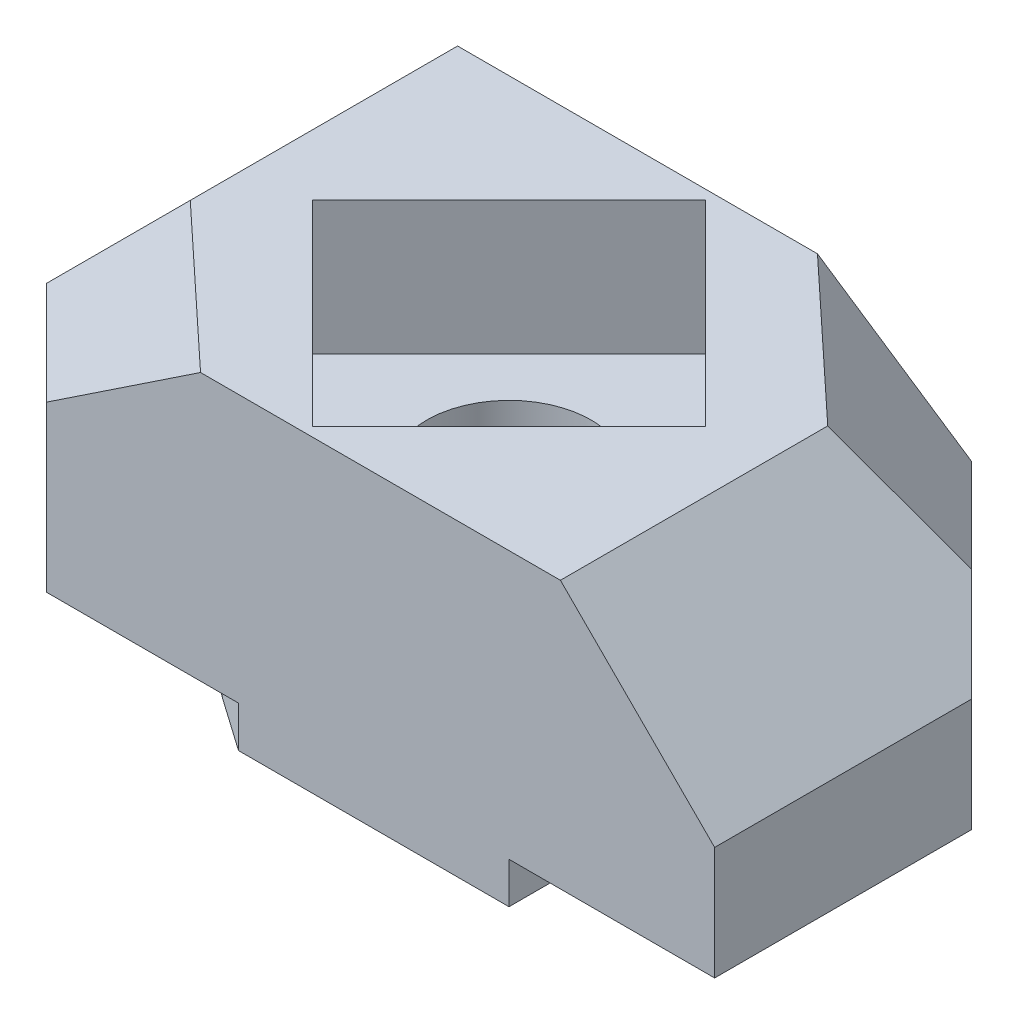
ISO-10303-21;
HEADER;
FILE_DESCRIPTION(('STEP AP214'),'2;1');
FILE_NAME('part.step','',(''),(''),'','','');
FILE_SCHEMA(('AUTOMOTIVE_DESIGN { 1 0 10303 214 1 1 1 1 }'));
ENDSEC;
DATA;
#1=APPLICATION_CONTEXT('core data for automotive mechanical design processes');
#2=APPLICATION_PROTOCOL_DEFINITION('international standard','automotive_design',2000,#1);
#3=PRODUCT_CONTEXT('',#1,'mechanical');
#4=PRODUCT('Part','Part','',(#3));
#5=PRODUCT_RELATED_PRODUCT_CATEGORY('part','',(#4));
#6=PRODUCT_DEFINITION_FORMATION('','',#4);
#7=PRODUCT_DEFINITION_CONTEXT('part definition',#1,'design');
#8=PRODUCT_DEFINITION('design','',#6,#7);
#9=PRODUCT_DEFINITION_SHAPE('','',#8);
#10=(LENGTH_UNIT() NAMED_UNIT(*) SI_UNIT(.MILLI.,.METRE.));
#11=(NAMED_UNIT(*) PLANE_ANGLE_UNIT() SI_UNIT($,.RADIAN.));
#12=(NAMED_UNIT(*) SI_UNIT($,.STERADIAN.) SOLID_ANGLE_UNIT());
#13=UNCERTAINTY_MEASURE_WITH_UNIT(LENGTH_MEASURE(1.E-05),#10,'distance_accuracy_value','');
#14=(GEOMETRIC_REPRESENTATION_CONTEXT(3) GLOBAL_UNCERTAINTY_ASSIGNED_CONTEXT((#13)) GLOBAL_UNIT_ASSIGNED_CONTEXT((#10,
#11,#12)) REPRESENTATION_CONTEXT('',''));
#15=CARTESIAN_POINT('',(0.,0.,0.));
#16=DIRECTION('',(0.,0.,1.));
#17=DIRECTION('',(1.,0.,0.));
#18=AXIS2_PLACEMENT_3D('',#15,#16,#17);
#19=CARTESIAN_POINT('',(3.20278422273782,4.80417633410673,-3.43155452436195));
#20=DIRECTION('',(-0.47684189230312,-0.71526283845468,0.510902027467629));
#21=DIRECTION('',(0.,-0.581238193719096,-0.813733471206735));
#22=AXIS2_PLACEMENT_3D('',#19,#20,#21);
#23=PLANE('',#22);
#24=DIRECTION('',(0.731055268242869,0.,0.682318250360011));
#25=VECTOR('',#24,1.);
#26=CARTESIAN_POINT('',(2.92636579572446,5.2,-3.13539192399049));
#27=LINE('',#26,#25);
#28=CARTESIAN_POINT('',(1.99999999999999,5.2,-4.));
#29=VERTEX_POINT('',#28);
#30=CARTESIAN_POINT('',(4.99999999999999,5.2,-1.2));
#31=VERTEX_POINT('',#30);
#32=EDGE_CURVE('E52',#29,#31,#27,.T.);
#33=ORIENTED_EDGE('',*,*,#32,.T.);
#34=DIRECTION('',(0.671492221553768,-0.671492221553768,-0.313363036725092));
#35=VECTOR('',#34,1.);
#36=CARTESIAN_POINT('',(4.74749498997995,5.45250501002004,-1.08216432865732));
#37=LINE('',#36,#35);
#38=CARTESIAN_POINT('',(6.90909090909089,3.29090909090909,-2.09090909090909));
#39=VERTEX_POINT('',#38);
#40=EDGE_CURVE('E12',#31,#39,#37,.T.);
#41=ORIENTED_EDGE('',*,*,#40,.T.);
#42=DIRECTION('',(0.706706267542868,0.0336526794068032,0.706706267542868));
#43=VECTOR('',#42,1.);
#44=CARTESIAN_POINT('',(5.04756511891278,3.20226500566252,-3.9524348810872));
#45=LINE('',#44,#43);
#46=CARTESIAN_POINT('',(4.99999999999999,3.2,-4.));
#47=VERTEX_POINT('',#46);
#48=EDGE_CURVE('E58',#39,#47,#45,.F.);
#49=ORIENTED_EDGE('',*,*,#48,.T.);
#50=DIRECTION('',(0.832050294337844,-0.554700196225229,0.));
#51=VECTOR('',#50,1.);
#52=CARTESIAN_POINT('',(-4.92307692307693,9.81538461538461,-4.));
#53=LINE('',#52,#51);
#54=EDGE_CURVE('E470',#29,#47,#53,.T.);
#55=ORIENTED_EDGE('',*,*,#54,.F.);
#56=EDGE_LOOP('',(#33,#41,#49,#55));
#57=FACE_BOUND('',#56,.T.);
#58=ADVANCED_FACE('F49',(#57),#23,.F.);
#59=CARTESIAN_POINT('',(-3.20278422273782,4.80417633410672,3.43155452436195));
#60=DIRECTION('',(0.47684189230312,-0.71526283845468,-0.510902027467629));
#61=DIRECTION('',(0.,0.581238193719096,-0.813733471206735));
#62=AXIS2_PLACEMENT_3D('',#59,#60,#61);
#63=PLANE('',#62);
#64=DIRECTION('',(-0.731055268242869,0.,-0.682318250360011));
#65=VECTOR('',#64,1.);
#66=CARTESIAN_POINT('',(-2.92636579572446,5.2,3.13539192399049));
#67=LINE('',#66,#65);
#68=CARTESIAN_POINT('',(-1.99999999999999,5.2,4.));
#69=VERTEX_POINT('',#68);
#70=CARTESIAN_POINT('',(-4.99999999999999,5.2,1.2));
#71=VERTEX_POINT('',#70);
#72=EDGE_CURVE('E475',#69,#71,#67,.T.);
#73=ORIENTED_EDGE('',*,*,#72,.T.);
#74=DIRECTION('',(-0.671492221553768,-0.671492221553768,0.313363036725092));
#75=VECTOR('',#74,1.);
#76=CARTESIAN_POINT('',(-4.74749498997995,5.45250501002004,1.08216432865732));
#77=LINE('',#76,#75);
#78=CARTESIAN_POINT('',(-6.90909090909089,3.29090909090909,2.09090909090909));
#79=VERTEX_POINT('',#78);
#80=EDGE_CURVE('E466',#71,#79,#77,.T.);
#81=ORIENTED_EDGE('',*,*,#80,.T.);
#82=DIRECTION('',(-0.706706267542868,0.0336526794068032,-0.706706267542868));
#83=VECTOR('',#82,1.);
#84=CARTESIAN_POINT('',(-5.04756511891278,3.20226500566252,3.9524348810872));
#85=LINE('',#84,#83);
#86=CARTESIAN_POINT('',(-4.99999999999999,3.2,4.));
#87=VERTEX_POINT('',#86);
#88=EDGE_CURVE('E471',#79,#87,#85,.F.);
#89=ORIENTED_EDGE('',*,*,#88,.T.);
#90=DIRECTION('',(-0.832050294337844,-0.554700196225229,0.));
#91=VECTOR('',#90,1.);
#92=CARTESIAN_POINT('',(-6.15384615384615,2.43076923076923,4.));
#93=LINE('',#92,#91);
#94=EDGE_CURVE('E465',#69,#87,#93,.T.);
#95=ORIENTED_EDGE('',*,*,#94,.F.);
#96=EDGE_LOOP('',(#73,#81,#89,#95));
#97=FACE_BOUND('',#96,.T.);
#98=ADVANCED_FACE('F550',(#97),#63,.F.);
#99=CARTESIAN_POINT('',(0.,0.,0.));
#100=DIRECTION('',(0.,1.,0.));
#101=DIRECTION('',(0.,0.,1.));
#102=AXIS2_PLACEMENT_3D('',#99,#100,#101);
#103=PLANE('',#102);
#104=DIRECTION('',(0.,0.,-1.));
#105=VECTOR('',#104,1.);
#106=CARTESIAN_POINT('',(-4.,0.,0.));
#107=LINE('',#106,#105);
#108=CARTESIAN_POINT('',(-4.,0.,0.));
#109=VERTEX_POINT('',#108);
#110=CARTESIAN_POINT('',(-4.,0.,-4.));
#111=VERTEX_POINT('',#110);
#112=EDGE_CURVE('E245',#109,#111,#107,.T.);
#113=ORIENTED_EDGE('',*,*,#112,.F.);
#114=CARTESIAN_POINT('',(0.,0.,0.));
#115=DIRECTION('',(0.,-1.,0.));
#116=DIRECTION('',(0.,0.,-1.));
#117=AXIS2_PLACEMENT_3D('',#114,#115,#116);
#118=CIRCLE('',#117,4.);
#119=CARTESIAN_POINT('',(-2.29430574540419,0.,3.27660817715596));
#120=VERTEX_POINT('',#119);
#121=EDGE_CURVE('E249',#120,#109,#118,.T.);
#122=ORIENTED_EDGE('',*,*,#121,.F.);
#123=DIRECTION('',(-0.819152044288991,0.,-0.573576436351047));
#124=VECTOR('',#123,1.);
#125=CARTESIAN_POINT('',(-2.29430574540419,0.,3.27660817715596));
#126=LINE('',#125,#124);
#127=CARTESIAN_POINT('',(-1.26119515551594,0.,4.));
#128=VERTEX_POINT('',#127);
#129=EDGE_CURVE('E292',#128,#120,#126,.T.);
#130=ORIENTED_EDGE('',*,*,#129,.F.);
#131=DIRECTION('',(1.,0.,0.));
#132=VECTOR('',#131,1.);
#133=CARTESIAN_POINT('',(-8.,0.,4.));
#134=LINE('',#133,#132);
#135=CARTESIAN_POINT('',(-4.99999999999999,0.,4.));
#136=VERTEX_POINT('',#135);
#137=EDGE_CURVE('E395',#136,#128,#134,.T.);
#138=ORIENTED_EDGE('',*,*,#137,.F.);
#139=DIRECTION('',(0.707106781186548,0.,0.707106781186548));
#140=VECTOR('',#139,1.);
#141=CARTESIAN_POINT('',(-4.99999999999999,0.,4.));
#142=LINE('',#141,#140);
#143=CARTESIAN_POINT('',(-8.,0.,0.999999999999987));
#144=VERTEX_POINT('',#143);
#145=EDGE_CURVE('E417',#136,#144,#142,.F.);
#146=ORIENTED_EDGE('',*,*,#145,.T.);
#147=DIRECTION('',(0.,0.,1.));
#148=VECTOR('',#147,1.);
#149=CARTESIAN_POINT('',(-8.,0.,-4.));
#150=LINE('',#149,#148);
#151=CARTESIAN_POINT('',(-8.,0.,-4.));
#152=VERTEX_POINT('',#151);
#153=EDGE_CURVE('E228',#152,#144,#150,.T.);
#154=ORIENTED_EDGE('',*,*,#153,.F.);
#155=DIRECTION('',(-1.,0.,0.));
#156=VECTOR('',#155,1.);
#157=CARTESIAN_POINT('',(-8.,0.,-4.));
#158=LINE('',#157,#156);
#159=EDGE_CURVE('E403',#111,#152,#158,.T.);
#160=ORIENTED_EDGE('',*,*,#159,.F.);
#161=EDGE_LOOP('',(#113,#122,#130,#138,#146,#154,#160));
#162=FACE_BOUND('',#161,.T.);
#163=ADVANCED_FACE('F524',(#162),#103,.F.);
#164=CARTESIAN_POINT('',(0.732996555665362,0.,1.42222222222222));
#165=DIRECTION('',(-0.458122847290851,0.,-0.888888888888889));
#166=DIRECTION('',(-0.888888888888889,0.,0.458122847290851));
#167=AXIS2_PLACEMENT_3D('',#164,#165,#166);
#168=PLANE('',#167);
#169=DIRECTION('',(0.,1.,0.));
#170=VECTOR('',#169,1.);
#171=CARTESIAN_POINT('',(0.,0.,1.8));
#172=LINE('',#171,#170);
#173=CARTESIAN_POINT('',(0.,-0.8,1.8));
#174=VERTEX_POINT('',#173);
#175=CARTESIAN_POINT('',(0.,2.6,1.8));
#176=VERTEX_POINT('',#175);
#177=EDGE_CURVE('E218',#174,#176,#172,.T.);
#178=ORIENTED_EDGE('',*,*,#177,.T.);
#179=DIRECTION('',(0.888888888888889,0.,-0.458122847290851));
#180=VECTOR('',#179,1.);
#181=CARTESIAN_POINT('',(0.732996555665362,2.6,1.42222222222222));
#182=LINE('',#181,#180);
#183=CARTESIAN_POINT('',(0.732996555665362,2.6,1.42222222222222));
#184=VERTEX_POINT('',#183);
#185=EDGE_CURVE('E376',#176,#184,#182,.T.);
#186=ORIENTED_EDGE('',*,*,#185,.T.);
#187=DIRECTION('',(0.,1.,0.));
#188=VECTOR('',#187,1.);
#189=CARTESIAN_POINT('',(0.732996555665362,0.,1.42222222222222));
#190=LINE('',#189,#188);
#191=CARTESIAN_POINT('',(0.732996555665362,-0.8,1.42222222222222));
#192=VERTEX_POINT('',#191);
#193=EDGE_CURVE('E235',#192,#184,#190,.T.);
#194=ORIENTED_EDGE('',*,*,#193,.F.);
#195=DIRECTION('',(0.888888888888889,0.,-0.458122847290852));
#196=VECTOR('',#195,1.);
#197=CARTESIAN_POINT('',(0.732996555665362,-0.8,1.42222222222222));
#198=LINE('',#197,#196);
#199=EDGE_CURVE('E232',#174,#192,#198,.T.);
#200=ORIENTED_EDGE('',*,*,#199,.F.);
#201=EDGE_LOOP('',(#178,#186,#194,#200));
#202=FACE_BOUND('',#201,.T.);
#203=ADVANCED_FACE('F233',(#202),#168,.T.);
#204=CARTESIAN_POINT('',(-0.732996555665362,0.,1.42222222222222));
#205=DIRECTION('',(0.458122847290851,0.,-0.888888888888889));
#206=DIRECTION('',(-0.888888888888889,0.,-0.458122847290851));
#207=AXIS2_PLACEMENT_3D('',#204,#205,#206);
#208=PLANE('',#207);
#209=DIRECTION('',(0.,1.,0.));
#210=VECTOR('',#209,1.);
#211=CARTESIAN_POINT('',(-0.732996555665362,0.,1.42222222222222));
#212=LINE('',#211,#210);
#213=CARTESIAN_POINT('',(-0.732996555665361,-0.8,1.42222222222222));
#214=VERTEX_POINT('',#213);
#215=CARTESIAN_POINT('',(-0.732996555665362,2.6,1.42222222222222));
#216=VERTEX_POINT('',#215);
#217=EDGE_CURVE('E229',#214,#216,#212,.T.);
#218=ORIENTED_EDGE('',*,*,#217,.T.);
#219=DIRECTION('',(0.888888888888889,0.,0.458122847290851));
#220=VECTOR('',#219,1.);
#221=CARTESIAN_POINT('',(-0.732996555665362,2.6,1.42222222222222));
#222=LINE('',#221,#220);
#223=EDGE_CURVE('E224',#216,#176,#222,.T.);
#224=ORIENTED_EDGE('',*,*,#223,.T.);
#225=ORIENTED_EDGE('',*,*,#177,.F.);
#226=DIRECTION('',(0.888888888888889,0.,0.458122847290852));
#227=VECTOR('',#226,1.);
#228=CARTESIAN_POINT('',(-0.732996555665362,-0.8,1.42222222222222));
#229=LINE('',#228,#227);
#230=EDGE_CURVE('E223',#214,#174,#229,.T.);
#231=ORIENTED_EDGE('',*,*,#230,.F.);
#232=EDGE_LOOP('',(#218,#224,#225,#231));
#233=FACE_BOUND('',#232,.T.);
#234=ADVANCED_FACE('F221',(#233),#208,.T.);
#235=CARTESIAN_POINT('',(0.,0.,0.));
#236=DIRECTION('',(0.,1.,0.));
#237=DIRECTION('',(0.,0.,1.));
#238=AXIS2_PLACEMENT_3D('',#235,#236,#237);
#239=CYLINDRICAL_SURFACE('',#238,1.6);
#240=CARTESIAN_POINT('',(0.,2.6,0.));
#241=DIRECTION('',(0.,1.,0.));
#242=DIRECTION('',(0.,0.,1.));
#243=AXIS2_PLACEMENT_3D('',#240,#241,#242);
#244=CIRCLE('',#243,1.6);
#245=EDGE_CURVE('E462',#216,#184,#244,.F.);
#246=ORIENTED_EDGE('',*,*,#245,.F.);
#247=ORIENTED_EDGE('',*,*,#217,.F.);
#248=CARTESIAN_POINT('',(0.,-0.8,0.));
#249=DIRECTION('',(0.,-1.,0.));
#250=DIRECTION('',(0.,0.,-1.));
#251=AXIS2_PLACEMENT_3D('',#248,#249,#250);
#252=CIRCLE('',#251,1.6);
#253=EDGE_CURVE('E240',#192,#214,#252,.F.);
#254=ORIENTED_EDGE('',*,*,#253,.F.);
#255=ORIENTED_EDGE('',*,*,#193,.T.);
#256=EDGE_LOOP('',(#246,#247,#254,#255));
#257=FACE_BOUND('',#256,.T.);
#258=ADVANCED_FACE('F601',(#257),#239,.F.);
#259=CARTESIAN_POINT('',(0.,5.2,0.));
#260=DIRECTION('',(0.,1.,0.));
#261=DIRECTION('',(0.,0.,1.));
#262=AXIS2_PLACEMENT_3D('',#259,#260,#261);
#263=PLANE('',#262);
#264=ORIENTED_EDGE('',*,*,#32,.F.);
#265=DIRECTION('',(-1.,0.,0.));
#266=VECTOR('',#265,1.);
#267=CARTESIAN_POINT('',(-8.,5.2,-4.));
#268=LINE('',#267,#266);
#269=CARTESIAN_POINT('',(-4.99999999999999,5.2,-4.));
#270=VERTEX_POINT('',#269);
#271=EDGE_CURVE('E386',#29,#270,#268,.T.);
#272=ORIENTED_EDGE('',*,*,#271,.T.);
#273=DIRECTION('',(0.,0.,1.));
#274=VECTOR('',#273,1.);
#275=CARTESIAN_POINT('',(-4.99999999999999,5.2,0.999999999999987));
#276=LINE('',#275,#274);
#277=EDGE_CURVE('E434',#270,#71,#276,.T.);
#278=ORIENTED_EDGE('',*,*,#277,.T.);
#279=ORIENTED_EDGE('',*,*,#72,.F.);
#280=DIRECTION('',(1.,0.,0.));
#281=VECTOR('',#280,1.);
#282=CARTESIAN_POINT('',(-8.,5.2,4.));
#283=LINE('',#282,#281);
#284=CARTESIAN_POINT('',(4.99999999999999,5.2,4.));
#285=VERTEX_POINT('',#284);
#286=EDGE_CURVE('E383',#69,#285,#283,.T.);
#287=ORIENTED_EDGE('',*,*,#286,.T.);
#288=DIRECTION('',(0.,0.,-1.));
#289=VECTOR('',#288,1.);
#290=CARTESIAN_POINT('',(4.99999999999999,5.2,-0.999999999999987));
#291=LINE('',#290,#289);
#292=EDGE_CURVE('E438',#285,#31,#291,.T.);
#293=ORIENTED_EDGE('',*,*,#292,.T.);
#294=EDGE_LOOP('',(#264,#272,#278,#279,#287,#293));
#295=FACE_BOUND('',#294,.T.);
#296=DIRECTION('',(-0.707106781186549,0.,0.707106781186546));
#297=VECTOR('',#296,1.);
#298=CARTESIAN_POINT('',(0.,5.2,-3.81837661840736));
#299=LINE('',#298,#297);
#300=CARTESIAN_POINT('',(0.,5.2,-3.81837661840736));
#301=VERTEX_POINT('',#300);
#302=CARTESIAN_POINT('',(-3.81837661840736,5.2,0.));
#303=VERTEX_POINT('',#302);
#304=EDGE_CURVE('E330',#301,#303,#299,.T.);
#305=ORIENTED_EDGE('',*,*,#304,.F.);
#306=DIRECTION('',(-0.707106781186546,0.,-0.707106781186549));
#307=VECTOR('',#306,1.);
#308=CARTESIAN_POINT('',(3.81837661840736,5.2,0.));
#309=LINE('',#308,#307);
#310=CARTESIAN_POINT('',(3.81837661840736,5.2,0.));
#311=VERTEX_POINT('',#310);
#312=EDGE_CURVE('E336',#311,#301,#309,.T.);
#313=ORIENTED_EDGE('',*,*,#312,.F.);
#314=DIRECTION('',(0.707106781186548,0.,-0.707106781186546));
#315=VECTOR('',#314,1.);
#316=CARTESIAN_POINT('',(0.,5.2,3.81837661840736));
#317=LINE('',#316,#315);
#318=CARTESIAN_POINT('',(0.,5.2,3.81837661840736));
#319=VERTEX_POINT('',#318);
#320=EDGE_CURVE('E355',#319,#311,#317,.T.);
#321=ORIENTED_EDGE('',*,*,#320,.F.);
#322=DIRECTION('',(0.707106781186546,0.,0.707106781186549));
#323=VECTOR('',#322,1.);
#324=CARTESIAN_POINT('',(-3.81837661840736,5.2,0.));
#325=LINE('',#324,#323);
#326=EDGE_CURVE('E351',#303,#319,#325,.T.);
#327=ORIENTED_EDGE('',*,*,#326,.F.);
#328=EDGE_LOOP('',(#305,#313,#321,#327));
#329=FACE_BOUND('',#328,.T.);
#330=ADVANCED_FACE('F489',(#295,#329),#263,.T.);
#331=DIRECTION('',(0.819152044288991,0.,0.573576436351047));
#332=VECTOR('',#331,1.);
#333=CARTESIAN_POINT('',(2.29430574540419,0.,-3.27660817715596));
#334=LINE('',#333,#332);
#335=CARTESIAN_POINT('',(1.26119515551593,0.,-4.));
#336=VERTEX_POINT('',#335);
#337=CARTESIAN_POINT('',(2.29430574540419,0.,-3.27660817715596));
#338=VERTEX_POINT('',#337);
#339=EDGE_CURVE('E281',#336,#338,#334,.T.);
#340=ORIENTED_EDGE('',*,*,#339,.F.);
#341=CARTESIAN_POINT('',(4.99999999999999,0.,-4.));
#342=VERTEX_POINT('',#341);
#343=EDGE_CURVE('E387',#342,#336,#158,.T.);
#344=ORIENTED_EDGE('',*,*,#343,.F.);
#345=DIRECTION('',(-0.707106781186548,0.,-0.707106781186548));
#346=VECTOR('',#345,1.);
#347=CARTESIAN_POINT('',(4.99999999999999,0.,-4.));
#348=LINE('',#347,#346);
#349=CARTESIAN_POINT('',(8.,0.,-0.999999999999987));
#350=VERTEX_POINT('',#349);
#351=EDGE_CURVE('E420',#342,#350,#348,.F.);
#352=ORIENTED_EDGE('',*,*,#351,.T.);
#353=DIRECTION('',(0.,0.,-1.));
#354=VECTOR('',#353,1.);
#355=CARTESIAN_POINT('',(8.,0.,-4.));
#356=LINE('',#355,#354);
#357=CARTESIAN_POINT('',(8.,0.,4.));
#358=VERTEX_POINT('',#357);
#359=EDGE_CURVE('E399',#358,#350,#356,.T.);
#360=ORIENTED_EDGE('',*,*,#359,.F.);
#361=CARTESIAN_POINT('',(4.,0.,4.));
#362=VERTEX_POINT('',#361);
#363=EDGE_CURVE('E394',#362,#358,#134,.T.);
#364=ORIENTED_EDGE('',*,*,#363,.F.);
#365=DIRECTION('',(0.,0.,-1.));
#366=VECTOR('',#365,1.);
#367=CARTESIAN_POINT('',(4.,0.,0.));
#368=LINE('',#367,#366);
#369=CARTESIAN_POINT('',(4.,0.,0.));
#370=VERTEX_POINT('',#369);
#371=EDGE_CURVE('E289',#362,#370,#368,.T.);
#372=ORIENTED_EDGE('',*,*,#371,.T.);
#373=CARTESIAN_POINT('',(0.,0.,0.));
#374=DIRECTION('',(0.,-1.,0.));
#375=DIRECTION('',(0.,0.,-1.));
#376=AXIS2_PLACEMENT_3D('',#373,#374,#375);
#377=CIRCLE('',#376,4.);
#378=EDGE_CURVE('E285',#338,#370,#377,.T.);
#379=ORIENTED_EDGE('',*,*,#378,.F.);
#380=EDGE_LOOP('',(#340,#344,#352,#360,#364,#372,#379));
#381=FACE_BOUND('',#380,.T.);
#382=ADVANCED_FACE('F504',(#381),#103,.F.);
#383=CARTESIAN_POINT('',(-8.,5.2,-4.));
#384=DIRECTION('',(1.,0.,0.));
#385=DIRECTION('',(0.,0.,-1.));
#386=AXIS2_PLACEMENT_3D('',#383,#384,#385);
#387=PLANE('',#386);
#388=DIRECTION('',(0.,1.,0.));
#389=VECTOR('',#388,1.);
#390=CARTESIAN_POINT('',(-8.,5.2,0.999999999999987));
#391=LINE('',#390,#389);
#392=CARTESIAN_POINT('',(-8.,2.19999999999999,0.999999999999987));
#393=VERTEX_POINT('',#392);
#394=EDGE_CURVE('E430',#144,#393,#391,.T.);
#395=ORIENTED_EDGE('',*,*,#394,.T.);
#396=DIRECTION('',(0.,0.,-1.));
#397=VECTOR('',#396,1.);
#398=CARTESIAN_POINT('',(-8.,2.19999999999999,-4.));
#399=LINE('',#398,#397);
#400=CARTESIAN_POINT('',(-8.,2.19999999999999,-4.));
#401=VERTEX_POINT('',#400);
#402=EDGE_CURVE('E455',#393,#401,#399,.T.);
#403=ORIENTED_EDGE('',*,*,#402,.T.);
#404=DIRECTION('',(0.,-1.,0.));
#405=VECTOR('',#404,1.);
#406=CARTESIAN_POINT('',(-8.,5.2,-4.));
#407=LINE('',#406,#405);
#408=EDGE_CURVE('E390',#401,#152,#407,.T.);
#409=ORIENTED_EDGE('',*,*,#408,.T.);
#410=ORIENTED_EDGE('',*,*,#153,.T.);
#411=EDGE_LOOP('',(#395,#403,#409,#410));
#412=FACE_BOUND('',#411,.T.);
#413=ADVANCED_FACE('F542',(#412),#387,.F.);
#414=CARTESIAN_POINT('',(-8.,5.2,4.));
#415=DIRECTION('',(0.,0.,-1.));
#416=DIRECTION('',(-1.,0.,0.));
#417=AXIS2_PLACEMENT_3D('',#414,#415,#416);
#418=PLANE('',#417);
#419=ORIENTED_EDGE('',*,*,#286,.F.);
#420=ORIENTED_EDGE('',*,*,#94,.T.);
#421=DIRECTION('',(0.,-1.,0.));
#422=VECTOR('',#421,1.);
#423=CARTESIAN_POINT('',(-4.99999999999999,5.2,4.));
#424=LINE('',#423,#422);
#425=EDGE_CURVE('E427',#87,#136,#424,.T.);
#426=ORIENTED_EDGE('',*,*,#425,.T.);
#427=ORIENTED_EDGE('',*,*,#137,.T.);
#428=DIRECTION('',(0.,1.,0.));
#429=VECTOR('',#428,1.);
#430=CARTESIAN_POINT('',(-1.26119515551594,-0.8,4.));
#431=LINE('',#430,#429);
#432=CARTESIAN_POINT('',(-1.26119515551594,-0.8,4.));
#433=VERTEX_POINT('',#432);
#434=EDGE_CURVE('E314',#433,#128,#431,.T.);
#435=ORIENTED_EDGE('',*,*,#434,.F.);
#436=DIRECTION('',(-1.,0.,0.));
#437=VECTOR('',#436,1.);
#438=CARTESIAN_POINT('',(0.,-0.8,4.));
#439=LINE('',#438,#437);
#440=CARTESIAN_POINT('',(4.,-0.8,4.));
#441=VERTEX_POINT('',#440);
#442=EDGE_CURVE('E265',#441,#433,#439,.T.);
#443=ORIENTED_EDGE('',*,*,#442,.F.);
#444=DIRECTION('',(0.,1.,0.));
#445=VECTOR('',#444,1.);
#446=CARTESIAN_POINT('',(4.,-0.8,4.));
#447=LINE('',#446,#445);
#448=EDGE_CURVE('E318',#441,#362,#447,.T.);
#449=ORIENTED_EDGE('',*,*,#448,.T.);
#450=ORIENTED_EDGE('',*,*,#363,.T.);
#451=DIRECTION('',(0.,-1.,0.));
#452=VECTOR('',#451,1.);
#453=CARTESIAN_POINT('',(8.,5.2,4.));
#454=LINE('',#453,#452);
#455=CARTESIAN_POINT('',(8.,2.19999999999999,4.));
#456=VERTEX_POINT('',#455);
#457=EDGE_CURVE('E410',#456,#358,#454,.T.);
#458=ORIENTED_EDGE('',*,*,#457,.F.);
#459=DIRECTION('',(-0.707106781186548,0.707106781186548,0.));
#460=VECTOR('',#459,1.);
#461=CARTESIAN_POINT('',(4.99999999999999,5.2,4.));
#462=LINE('',#461,#460);
#463=EDGE_CURVE('E448',#456,#285,#462,.T.);
#464=ORIENTED_EDGE('',*,*,#463,.T.);
#465=EDGE_LOOP('',(#419,#420,#426,#427,#435,#443,#449,#450,#458,#464));
#466=FACE_BOUND('',#465,.T.);
#467=ADVANCED_FACE('F498',(#466),#418,.F.);
#468=CARTESIAN_POINT('',(8.,5.2,-4.));
#469=DIRECTION('',(-1.,0.,0.));
#470=DIRECTION('',(0.,0.,1.));
#471=AXIS2_PLACEMENT_3D('',#468,#469,#470);
#472=PLANE('',#471);
#473=DIRECTION('',(0.,1.,0.));
#474=VECTOR('',#473,1.);
#475=CARTESIAN_POINT('',(8.,5.2,-0.999999999999987));
#476=LINE('',#475,#474);
#477=CARTESIAN_POINT('',(8.,2.19999999999999,-0.999999999999987));
#478=VERTEX_POINT('',#477);
#479=EDGE_CURVE('E423',#350,#478,#476,.T.);
#480=ORIENTED_EDGE('',*,*,#479,.T.);
#481=DIRECTION('',(0.,0.,1.));
#482=VECTOR('',#481,1.);
#483=CARTESIAN_POINT('',(8.,2.19999999999999,4.));
#484=LINE('',#483,#482);
#485=EDGE_CURVE('E445',#478,#456,#484,.T.);
#486=ORIENTED_EDGE('',*,*,#485,.T.);
#487=ORIENTED_EDGE('',*,*,#457,.T.);
#488=ORIENTED_EDGE('',*,*,#359,.T.);
#489=EDGE_LOOP('',(#480,#486,#487,#488));
#490=FACE_BOUND('',#489,.T.);
#491=ADVANCED_FACE('F501',(#490),#472,.F.);
#492=CARTESIAN_POINT('',(-8.,5.2,-4.));
#493=DIRECTION('',(0.,0.,1.));
#494=DIRECTION('',(1.,0.,0.));
#495=AXIS2_PLACEMENT_3D('',#492,#493,#494);
#496=PLANE('',#495);
#497=ORIENTED_EDGE('',*,*,#271,.F.);
#498=ORIENTED_EDGE('',*,*,#54,.T.);
#499=DIRECTION('',(0.,-1.,0.));
#500=VECTOR('',#499,1.);
#501=CARTESIAN_POINT('',(4.99999999999999,5.2,-4.));
#502=LINE('',#501,#500);
#503=EDGE_CURVE('E414',#47,#342,#502,.T.);
#504=ORIENTED_EDGE('',*,*,#503,.T.);
#505=ORIENTED_EDGE('',*,*,#343,.T.);
#506=DIRECTION('',(0.,1.,0.));
#507=VECTOR('',#506,1.);
#508=CARTESIAN_POINT('',(1.26119515551594,-0.8,-4.));
#509=LINE('',#508,#507);
#510=CARTESIAN_POINT('',(1.26119515551594,-0.8,-4.));
#511=VERTEX_POINT('',#510);
#512=EDGE_CURVE('E280',#511,#336,#509,.T.);
#513=ORIENTED_EDGE('',*,*,#512,.F.);
#514=DIRECTION('',(1.,0.,0.));
#515=VECTOR('',#514,1.);
#516=CARTESIAN_POINT('',(0.,-0.8,-4.));
#517=LINE('',#516,#515);
#518=CARTESIAN_POINT('',(-4.,-0.8,-4.));
#519=VERTEX_POINT('',#518);
#520=EDGE_CURVE('E277',#519,#511,#517,.T.);
#521=ORIENTED_EDGE('',*,*,#520,.F.);
#522=DIRECTION('',(0.,1.,0.));
#523=VECTOR('',#522,1.);
#524=CARTESIAN_POINT('',(-4.,-0.8,-4.));
#525=LINE('',#524,#523);
#526=EDGE_CURVE('E302',#519,#111,#525,.T.);
#527=ORIENTED_EDGE('',*,*,#526,.T.);
#528=ORIENTED_EDGE('',*,*,#159,.T.);
#529=ORIENTED_EDGE('',*,*,#408,.F.);
#530=DIRECTION('',(0.707106781186548,0.707106781186548,0.));
#531=VECTOR('',#530,1.);
#532=CARTESIAN_POINT('',(-4.99999999999999,5.2,-4.));
#533=LINE('',#532,#531);
#534=EDGE_CURVE('E458',#401,#270,#533,.T.);
#535=ORIENTED_EDGE('',*,*,#534,.T.);
#536=EDGE_LOOP('',(#497,#498,#504,#505,#513,#521,#527,#528,#529,#535));
#537=FACE_BOUND('',#536,.T.);
#538=ADVANCED_FACE('F508',(#537),#496,.F.);
#539=CARTESIAN_POINT('',(4.99999999999999,5.2,-4.));
#540=DIRECTION('',(-0.707106781186547,0.,0.707106781186547));
#541=DIRECTION('',(0.,-1.,0.));
#542=AXIS2_PLACEMENT_3D('',#539,#540,#541);
#543=PLANE('',#542);
#544=ORIENTED_EDGE('',*,*,#48,.F.);
#545=DIRECTION('',(-0.577350269189626,0.577350269189626,-0.577350269189626));
#546=VECTOR('',#545,1.);
#547=CARTESIAN_POINT('',(4.99999999999999,5.2,-4.));
#548=LINE('',#547,#546);
#549=EDGE_CURVE('E442',#39,#478,#548,.F.);
#550=ORIENTED_EDGE('',*,*,#549,.T.);
#551=ORIENTED_EDGE('',*,*,#479,.F.);
#552=ORIENTED_EDGE('',*,*,#351,.F.);
#553=ORIENTED_EDGE('',*,*,#503,.F.);
#554=EDGE_LOOP('',(#544,#550,#551,#552,#553));
#555=FACE_BOUND('',#554,.T.);
#556=ADVANCED_FACE('F507',(#555),#543,.F.);
#557=CARTESIAN_POINT('',(-4.99999999999999,5.2,4.));
#558=DIRECTION('',(0.707106781186547,0.,-0.707106781186547));
#559=DIRECTION('',(0.,-1.,0.));
#560=AXIS2_PLACEMENT_3D('',#557,#558,#559);
#561=PLANE('',#560);
#562=ORIENTED_EDGE('',*,*,#88,.F.);
#563=DIRECTION('',(0.577350269189626,0.577350269189626,0.577350269189626));
#564=VECTOR('',#563,1.);
#565=CARTESIAN_POINT('',(-4.99999999999999,5.2,4.));
#566=LINE('',#565,#564);
#567=EDGE_CURVE('E452',#79,#393,#566,.F.);
#568=ORIENTED_EDGE('',*,*,#567,.T.);
#569=ORIENTED_EDGE('',*,*,#394,.F.);
#570=ORIENTED_EDGE('',*,*,#145,.F.);
#571=ORIENTED_EDGE('',*,*,#425,.F.);
#572=EDGE_LOOP('',(#562,#568,#569,#570,#571));
#573=FACE_BOUND('',#572,.T.);
#574=ADVANCED_FACE('F540',(#573),#561,.F.);
#575=CARTESIAN_POINT('',(4.99999999999999,5.2,0.));
#576=DIRECTION('',(0.707106781186547,0.707106781186547,0.));
#577=DIRECTION('',(0.,0.,1.));
#578=AXIS2_PLACEMENT_3D('',#575,#576,#577);
#579=PLANE('',#578);
#580=ORIENTED_EDGE('',*,*,#40,.F.);
#581=ORIENTED_EDGE('',*,*,#292,.F.);
#582=ORIENTED_EDGE('',*,*,#463,.F.);
#583=ORIENTED_EDGE('',*,*,#485,.F.);
#584=ORIENTED_EDGE('',*,*,#549,.F.);
#585=EDGE_LOOP('',(#580,#581,#582,#583,#584));
#586=FACE_BOUND('',#585,.T.);
#587=ADVANCED_FACE('F494',(#586),#579,.T.);
#588=CARTESIAN_POINT('',(-4.99999999999999,5.2,0.));
#589=DIRECTION('',(-0.707106781186547,0.707106781186547,0.));
#590=DIRECTION('',(0.,0.,-1.));
#591=AXIS2_PLACEMENT_3D('',#588,#589,#590);
#592=PLANE('',#591);
#593=ORIENTED_EDGE('',*,*,#80,.F.);
#594=ORIENTED_EDGE('',*,*,#277,.F.);
#595=ORIENTED_EDGE('',*,*,#534,.F.);
#596=ORIENTED_EDGE('',*,*,#402,.F.);
#597=ORIENTED_EDGE('',*,*,#567,.F.);
#598=EDGE_LOOP('',(#593,#594,#595,#596,#597));
#599=FACE_BOUND('',#598,.T.);
#600=ADVANCED_FACE('F547',(#599),#592,.T.);
#601=CARTESIAN_POINT('',(0.,2.6,-3.81837661840736));
#602=DIRECTION('',(-0.707106781186546,0.,-0.707106781186549));
#603=DIRECTION('',(-0.707106781186549,0.,0.707106781186546));
#604=AXIS2_PLACEMENT_3D('',#601,#602,#603);
#605=PLANE('',#604);
#606=ORIENTED_EDGE('',*,*,#304,.T.);
#607=DIRECTION('',(0.,1.,0.));
#608=VECTOR('',#607,1.);
#609=CARTESIAN_POINT('',(-3.81837661840736,2.6,0.));
#610=LINE('',#609,#608);
#611=CARTESIAN_POINT('',(-3.81837661840736,2.6,0.));
#612=VERTEX_POINT('',#611);
#613=EDGE_CURVE('E348',#612,#303,#610,.T.);
#614=ORIENTED_EDGE('',*,*,#613,.F.);
#615=DIRECTION('',(-0.707106781186549,0.,0.707106781186546));
#616=VECTOR('',#615,1.);
#617=CARTESIAN_POINT('',(0.,2.6,-3.81837661840736));
#618=LINE('',#617,#616);
#619=CARTESIAN_POINT('',(0.,2.6,-3.81837661840736));
#620=VERTEX_POINT('',#619);
#621=EDGE_CURVE('E331',#620,#612,#618,.T.);
#622=ORIENTED_EDGE('',*,*,#621,.F.);
#623=DIRECTION('',(0.,1.,0.));
#624=VECTOR('',#623,1.);
#625=CARTESIAN_POINT('',(0.,2.6,-3.81837661840736));
#626=LINE('',#625,#624);
#627=EDGE_CURVE('E362',#620,#301,#626,.T.);
#628=ORIENTED_EDGE('',*,*,#627,.T.);
#629=EDGE_LOOP('',(#606,#614,#622,#628));
#630=FACE_BOUND('',#629,.T.);
#631=ADVANCED_FACE('F588',(#630),#605,.F.);
#632=CARTESIAN_POINT('',(3.81837661840736,2.6,0.));
#633=DIRECTION('',(0.707106781186549,0.,-0.707106781186546));
#634=DIRECTION('',(-0.707106781186546,0.,-0.707106781186549));
#635=AXIS2_PLACEMENT_3D('',#632,#633,#634);
#636=PLANE('',#635);
#637=ORIENTED_EDGE('',*,*,#312,.T.);
#638=ORIENTED_EDGE('',*,*,#627,.F.);
#639=DIRECTION('',(-0.707106781186546,0.,-0.707106781186549));
#640=VECTOR('',#639,1.);
#641=CARTESIAN_POINT('',(3.81837661840736,2.6,0.));
#642=LINE('',#641,#640);
#643=CARTESIAN_POINT('',(3.81837661840736,2.6,0.));
#644=VERTEX_POINT('',#643);
#645=EDGE_CURVE('E344',#644,#620,#642,.T.);
#646=ORIENTED_EDGE('',*,*,#645,.F.);
#647=DIRECTION('',(0.,1.,0.));
#648=VECTOR('',#647,1.);
#649=CARTESIAN_POINT('',(3.81837661840736,2.6,0.));
#650=LINE('',#649,#648);
#651=EDGE_CURVE('E365',#644,#311,#650,.T.);
#652=ORIENTED_EDGE('',*,*,#651,.T.);
#653=EDGE_LOOP('',(#637,#638,#646,#652));
#654=FACE_BOUND('',#653,.T.);
#655=ADVANCED_FACE('F584',(#654),#636,.F.);
#656=CARTESIAN_POINT('',(0.,2.6,3.81837661840736));
#657=DIRECTION('',(0.707106781186546,0.,0.707106781186549));
#658=DIRECTION('',(0.707106781186549,0.,-0.707106781186546));
#659=AXIS2_PLACEMENT_3D('',#656,#657,#658);
#660=PLANE('',#659);
#661=ORIENTED_EDGE('',*,*,#320,.T.);
#662=ORIENTED_EDGE('',*,*,#651,.F.);
#663=DIRECTION('',(0.707106781186548,0.,-0.707106781186546));
#664=VECTOR('',#663,1.);
#665=CARTESIAN_POINT('',(0.,2.6,3.81837661840736));
#666=LINE('',#665,#664);
#667=CARTESIAN_POINT('',(0.,2.6,3.81837661840736));
#668=VERTEX_POINT('',#667);
#669=EDGE_CURVE('E340',#668,#644,#666,.T.);
#670=ORIENTED_EDGE('',*,*,#669,.F.);
#671=DIRECTION('',(0.,1.,0.));
#672=VECTOR('',#671,1.);
#673=CARTESIAN_POINT('',(0.,2.6,3.81837661840736));
#674=LINE('',#673,#672);
#675=EDGE_CURVE('E368',#668,#319,#674,.T.);
#676=ORIENTED_EDGE('',*,*,#675,.T.);
#677=EDGE_LOOP('',(#661,#662,#670,#676));
#678=FACE_BOUND('',#677,.T.);
#679=ADVANCED_FACE('F587',(#678),#660,.F.);
#680=CARTESIAN_POINT('',(-3.81837661840736,2.6,0.));
#681=DIRECTION('',(-0.707106781186549,0.,0.707106781186546));
#682=DIRECTION('',(0.707106781186546,0.,0.707106781186549));
#683=AXIS2_PLACEMENT_3D('',#680,#681,#682);
#684=PLANE('',#683);
#685=ORIENTED_EDGE('',*,*,#326,.T.);
#686=ORIENTED_EDGE('',*,*,#675,.F.);
#687=DIRECTION('',(0.707106781186546,0.,0.707106781186549));
#688=VECTOR('',#687,1.);
#689=CARTESIAN_POINT('',(-3.81837661840736,2.6,0.));
#690=LINE('',#689,#688);
#691=EDGE_CURVE('E335',#612,#668,#690,.T.);
#692=ORIENTED_EDGE('',*,*,#691,.F.);
#693=ORIENTED_EDGE('',*,*,#613,.T.);
#694=EDGE_LOOP('',(#685,#686,#692,#693));
#695=FACE_BOUND('',#694,.T.);
#696=ADVANCED_FACE('F582',(#695),#684,.F.);
#697=CARTESIAN_POINT('',(0.,2.6,0.));
#698=DIRECTION('',(0.,1.,0.));
#699=DIRECTION('',(0.,0.,1.));
#700=AXIS2_PLACEMENT_3D('',#697,#698,#699);
#701=PLANE('',#700);
#702=ORIENTED_EDGE('',*,*,#223,.F.);
#703=ORIENTED_EDGE('',*,*,#245,.T.);
#704=ORIENTED_EDGE('',*,*,#185,.F.);
#705=EDGE_LOOP('',(#702,#703,#704));
#706=FACE_BOUND('',#705,.T.);
#707=ORIENTED_EDGE('',*,*,#621,.T.);
#708=ORIENTED_EDGE('',*,*,#691,.T.);
#709=ORIENTED_EDGE('',*,*,#669,.T.);
#710=ORIENTED_EDGE('',*,*,#645,.T.);
#711=EDGE_LOOP('',(#707,#708,#709,#710));
#712=FACE_BOUND('',#711,.T.);
#713=ADVANCED_FACE('F579',(#706,#712),#701,.T.);
#714=CARTESIAN_POINT('',(2.29430574540419,-0.8,-3.27660817715596));
#715=DIRECTION('',(-0.573576436351047,0.,0.819152044288991));
#716=DIRECTION('',(0.819152044288991,0.,0.573576436351047));
#717=AXIS2_PLACEMENT_3D('',#714,#715,#716);
#718=PLANE('',#717);
#719=ORIENTED_EDGE('',*,*,#339,.T.);
#720=DIRECTION('',(0.,1.,0.));
#721=VECTOR('',#720,1.);
#722=CARTESIAN_POINT('',(2.29430574540419,-0.8,-3.27660817715596));
#723=LINE('',#722,#721);
#724=CARTESIAN_POINT('',(2.29430574540419,-0.8,-3.27660817715596));
#725=VERTEX_POINT('',#724);
#726=EDGE_CURVE('E326',#725,#338,#723,.T.);
#727=ORIENTED_EDGE('',*,*,#726,.F.);
#728=DIRECTION('',(0.819152044288991,0.,0.573576436351047));
#729=VECTOR('',#728,1.);
#730=CARTESIAN_POINT('',(2.29430574540419,-0.8,-3.27660817715596));
#731=LINE('',#730,#729);
#732=EDGE_CURVE('E254',#511,#725,#731,.T.);
#733=ORIENTED_EDGE('',*,*,#732,.F.);
#734=ORIENTED_EDGE('',*,*,#512,.T.);
#735=EDGE_LOOP('',(#719,#727,#733,#734));
#736=FACE_BOUND('',#735,.T.);
#737=ADVANCED_FACE('F513',(#736),#718,.F.);
#738=CARTESIAN_POINT('',(0.,-0.8,0.));
#739=DIRECTION('',(0.,1.,0.));
#740=DIRECTION('',(0.,0.,1.));
#741=AXIS2_PLACEMENT_3D('',#738,#739,#740);
#742=CYLINDRICAL_SURFACE('',#741,4.);
#743=ORIENTED_EDGE('',*,*,#378,.T.);
#744=DIRECTION('',(0.,1.,0.));
#745=VECTOR('',#744,1.);
#746=CARTESIAN_POINT('',(4.,-0.8,0.));
#747=LINE('',#746,#745);
#748=CARTESIAN_POINT('',(4.,-0.8,0.));
#749=VERTEX_POINT('',#748);
#750=EDGE_CURVE('E322',#749,#370,#747,.T.);
#751=ORIENTED_EDGE('',*,*,#750,.F.);
#752=CARTESIAN_POINT('',(0.,-0.8,0.));
#753=DIRECTION('',(0.,-1.,0.));
#754=DIRECTION('',(0.,0.,-1.));
#755=AXIS2_PLACEMENT_3D('',#752,#753,#754);
#756=CIRCLE('',#755,4.);
#757=EDGE_CURVE('E258',#725,#749,#756,.T.);
#758=ORIENTED_EDGE('',*,*,#757,.F.);
#759=ORIENTED_EDGE('',*,*,#726,.T.);
#760=EDGE_LOOP('',(#743,#751,#758,#759));
#761=FACE_BOUND('',#760,.T.);
#762=ADVANCED_FACE('F572',(#761),#742,.T.);
#763=CARTESIAN_POINT('',(4.,-0.8,0.));
#764=DIRECTION('',(1.,0.,0.));
#765=DIRECTION('',(0.,0.,-1.));
#766=AXIS2_PLACEMENT_3D('',#763,#764,#765);
#767=PLANE('',#766);
#768=ORIENTED_EDGE('',*,*,#371,.F.);
#769=ORIENTED_EDGE('',*,*,#448,.F.);
#770=DIRECTION('',(0.,0.,-1.));
#771=VECTOR('',#770,1.);
#772=CARTESIAN_POINT('',(4.,-0.8,0.));
#773=LINE('',#772,#771);
#774=EDGE_CURVE('E261',#441,#749,#773,.T.);
#775=ORIENTED_EDGE('',*,*,#774,.T.);
#776=ORIENTED_EDGE('',*,*,#750,.T.);
#777=EDGE_LOOP('',(#768,#769,#775,#776));
#778=FACE_BOUND('',#777,.T.);
#779=ADVANCED_FACE('F569',(#778),#767,.T.);
#780=CARTESIAN_POINT('',(-2.29430574540419,-0.8,3.27660817715596));
#781=DIRECTION('',(0.573576436351047,0.,-0.819152044288991));
#782=DIRECTION('',(-0.819152044288991,0.,-0.573576436351047));
#783=AXIS2_PLACEMENT_3D('',#780,#781,#782);
#784=PLANE('',#783);
#785=ORIENTED_EDGE('',*,*,#129,.T.);
#786=DIRECTION('',(0.,1.,0.));
#787=VECTOR('',#786,1.);
#788=CARTESIAN_POINT('',(-2.29430574540419,-0.8,3.27660817715596));
#789=LINE('',#788,#787);
#790=CARTESIAN_POINT('',(-2.29430574540419,-0.8,3.27660817715596));
#791=VERTEX_POINT('',#790);
#792=EDGE_CURVE('E310',#791,#120,#789,.T.);
#793=ORIENTED_EDGE('',*,*,#792,.F.);
#794=DIRECTION('',(-0.819152044288991,0.,-0.573576436351047));
#795=VECTOR('',#794,1.);
#796=CARTESIAN_POINT('',(-2.29430574540419,-0.8,3.27660817715596));
#797=LINE('',#796,#795);
#798=EDGE_CURVE('E268',#433,#791,#797,.T.);
#799=ORIENTED_EDGE('',*,*,#798,.F.);
#800=ORIENTED_EDGE('',*,*,#434,.T.);
#801=EDGE_LOOP('',(#785,#793,#799,#800));
#802=FACE_BOUND('',#801,.T.);
#803=ADVANCED_FACE('F532',(#802),#784,.F.);
#804=CARTESIAN_POINT('',(0.,-0.8,0.));
#805=DIRECTION('',(0.,1.,0.));
#806=DIRECTION('',(0.,0.,1.));
#807=AXIS2_PLACEMENT_3D('',#804,#805,#806);
#808=CYLINDRICAL_SURFACE('',#807,4.);
#809=ORIENTED_EDGE('',*,*,#121,.T.);
#810=DIRECTION('',(0.,1.,0.));
#811=VECTOR('',#810,1.);
#812=CARTESIAN_POINT('',(-4.,-0.8,0.));
#813=LINE('',#812,#811);
#814=CARTESIAN_POINT('',(-4.,-0.8,0.));
#815=VERTEX_POINT('',#814);
#816=EDGE_CURVE('E306',#815,#109,#813,.T.);
#817=ORIENTED_EDGE('',*,*,#816,.F.);
#818=CARTESIAN_POINT('',(0.,-0.8,0.));
#819=DIRECTION('',(0.,-1.,0.));
#820=DIRECTION('',(0.,0.,-1.));
#821=AXIS2_PLACEMENT_3D('',#818,#819,#820);
#822=CIRCLE('',#821,4.);
#823=EDGE_CURVE('E271',#791,#815,#822,.T.);
#824=ORIENTED_EDGE('',*,*,#823,.F.);
#825=ORIENTED_EDGE('',*,*,#792,.T.);
#826=EDGE_LOOP('',(#809,#817,#824,#825));
#827=FACE_BOUND('',#826,.T.);
#828=ADVANCED_FACE('F527',(#827),#808,.T.);
#829=CARTESIAN_POINT('',(-4.,-0.8,0.));
#830=DIRECTION('',(1.,0.,0.));
#831=DIRECTION('',(0.,0.,-1.));
#832=AXIS2_PLACEMENT_3D('',#829,#830,#831);
#833=PLANE('',#832);
#834=ORIENTED_EDGE('',*,*,#112,.T.);
#835=ORIENTED_EDGE('',*,*,#526,.F.);
#836=DIRECTION('',(0.,0.,-1.));
#837=VECTOR('',#836,1.);
#838=CARTESIAN_POINT('',(-4.,-0.8,0.));
#839=LINE('',#838,#837);
#840=EDGE_CURVE('E274',#815,#519,#839,.T.);
#841=ORIENTED_EDGE('',*,*,#840,.F.);
#842=ORIENTED_EDGE('',*,*,#816,.T.);
#843=EDGE_LOOP('',(#834,#835,#841,#842));
#844=FACE_BOUND('',#843,.T.);
#845=ADVANCED_FACE('F521',(#844),#833,.F.);
#846=CARTESIAN_POINT('',(0.,-0.8,0.));
#847=DIRECTION('',(0.,-1.,0.));
#848=DIRECTION('',(0.,0.,-1.));
#849=AXIS2_PLACEMENT_3D('',#846,#847,#848);
#850=PLANE('',#849);
#851=ORIENTED_EDGE('',*,*,#230,.T.);
#852=ORIENTED_EDGE('',*,*,#199,.T.);
#853=ORIENTED_EDGE('',*,*,#253,.T.);
#854=EDGE_LOOP('',(#851,#852,#853));
#855=FACE_BOUND('',#854,.T.);
#856=ORIENTED_EDGE('',*,*,#732,.T.);
#857=ORIENTED_EDGE('',*,*,#757,.T.);
#858=ORIENTED_EDGE('',*,*,#774,.F.);
#859=ORIENTED_EDGE('',*,*,#442,.T.);
#860=ORIENTED_EDGE('',*,*,#798,.T.);
#861=ORIENTED_EDGE('',*,*,#823,.T.);
#862=ORIENTED_EDGE('',*,*,#840,.T.);
#863=ORIENTED_EDGE('',*,*,#520,.T.);
#864=EDGE_LOOP('',(#856,#857,#858,#859,#860,#861,#862,#863));
#865=FACE_BOUND('',#864,.T.);
#866=ADVANCED_FACE('F242',(#855,#865),#850,.T.);
#867=CLOSED_SHELL('',(#58,#98,#163,#203,#234,#258,#330,#382,#413,#467,#491,#538,#556,#574,#587,
#600,#631,#655,#679,#696,#713,#737,#762,#779,#803,#828,#845,#866));
#868=MANIFOLD_SOLID_BREP('B2',#867);
#869=ADVANCED_BREP_SHAPE_REPRESENTATION('',(#18,#868),#14);
#870=SHAPE_DEFINITION_REPRESENTATION(#9,#869);
ENDSEC;
END-ISO-10303-21;
